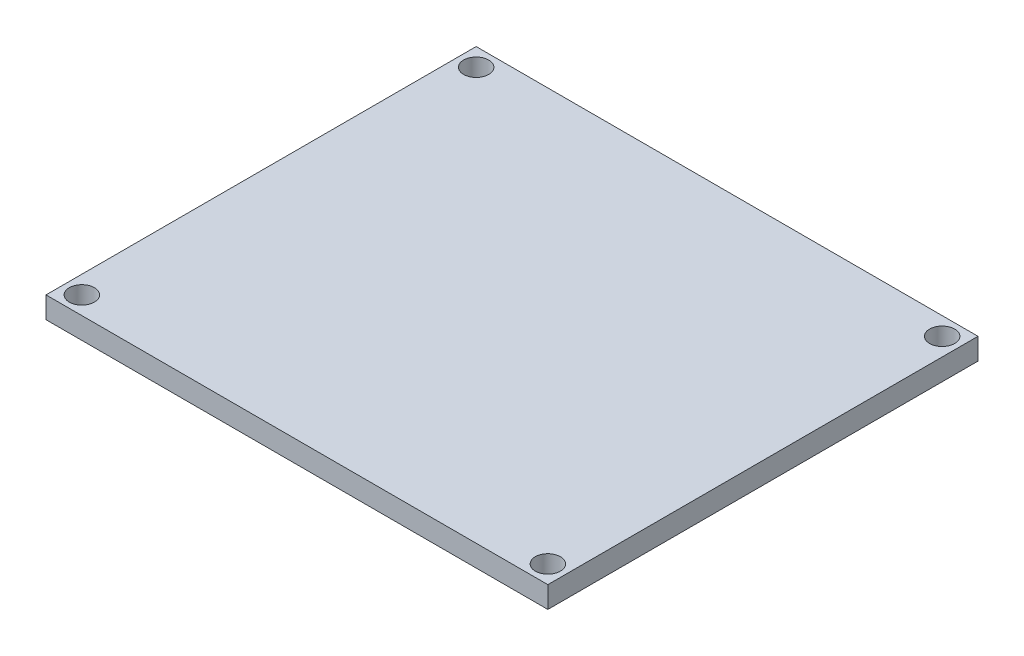
ISO-10303-21;
HEADER;
FILE_DESCRIPTION(('STEP AP214'),'2;1');
FILE_NAME('part.step','',(''),(''),'','','');
FILE_SCHEMA(('AUTOMOTIVE_DESIGN { 1 0 10303 214 1 1 1 1 }'));
ENDSEC;
DATA;
#1=APPLICATION_CONTEXT('core data for automotive mechanical design processes');
#2=APPLICATION_PROTOCOL_DEFINITION('international standard','automotive_design',2000,#1);
#3=PRODUCT_CONTEXT('',#1,'mechanical');
#4=PRODUCT('Part','Part','',(#3));
#5=PRODUCT_RELATED_PRODUCT_CATEGORY('part','',(#4));
#6=PRODUCT_DEFINITION_FORMATION('','',#4);
#7=PRODUCT_DEFINITION_CONTEXT('part definition',#1,'design');
#8=PRODUCT_DEFINITION('design','',#6,#7);
#9=PRODUCT_DEFINITION_SHAPE('','',#8);
#10=(LENGTH_UNIT() NAMED_UNIT(*) SI_UNIT(.MILLI.,.METRE.));
#11=(NAMED_UNIT(*) PLANE_ANGLE_UNIT() SI_UNIT($,.RADIAN.));
#12=(NAMED_UNIT(*) SI_UNIT($,.STERADIAN.) SOLID_ANGLE_UNIT());
#13=UNCERTAINTY_MEASURE_WITH_UNIT(LENGTH_MEASURE(1.E-05),#10,'distance_accuracy_value','');
#14=(GEOMETRIC_REPRESENTATION_CONTEXT(3) GLOBAL_UNCERTAINTY_ASSIGNED_CONTEXT((#13)) GLOBAL_UNIT_ASSIGNED_CONTEXT((#10,
#11,#12)) REPRESENTATION_CONTEXT('',''));
#15=CARTESIAN_POINT('',(0.,0.,0.));
#16=DIRECTION('',(0.,0.,1.));
#17=DIRECTION('',(1.,0.,0.));
#18=AXIS2_PLACEMENT_3D('',#15,#16,#17);
#19=CARTESIAN_POINT('',(-30.9375,3.,11.40625));
#20=DIRECTION('',(1.,0.,0.));
#21=DIRECTION('',(0.,0.,-1.));
#22=AXIS2_PLACEMENT_3D('',#19,#20,#21);
#23=PLANE('',#22);
#24=DIRECTION('',(0.,0.,1.));
#25=VECTOR('',#24,1.);
#26=CARTESIAN_POINT('',(-30.9375,0.,11.40625));
#27=LINE('',#26,#25);
#28=CARTESIAN_POINT('',(-30.9375,0.,-48.59375));
#29=VERTEX_POINT('',#28);
#30=CARTESIAN_POINT('',(-30.9375,0.,11.40625));
#31=VERTEX_POINT('',#30);
#32=EDGE_CURVE('E99',#29,#31,#27,.T.);
#33=ORIENTED_EDGE('',*,*,#32,.T.);
#34=DIRECTION('',(0.,-1.,0.));
#35=VECTOR('',#34,1.);
#36=CARTESIAN_POINT('',(-30.9375,3.,11.40625));
#37=LINE('',#36,#35);
#38=CARTESIAN_POINT('',(-30.9375,3.,11.40625));
#39=VERTEX_POINT('',#38);
#40=EDGE_CURVE('E11',#39,#31,#37,.T.);
#41=ORIENTED_EDGE('',*,*,#40,.F.);
#42=DIRECTION('',(0.,0.,1.));
#43=VECTOR('',#42,1.);
#44=CARTESIAN_POINT('',(-30.9375,3.,11.40625));
#45=LINE('',#44,#43);
#46=CARTESIAN_POINT('',(-30.9375,3.,-48.59375));
#47=VERTEX_POINT('',#46);
#48=EDGE_CURVE('E86',#47,#39,#45,.T.);
#49=ORIENTED_EDGE('',*,*,#48,.F.);
#50=DIRECTION('',(0.,-1.,0.));
#51=VECTOR('',#50,1.);
#52=CARTESIAN_POINT('',(-30.9375,3.,-48.59375));
#53=LINE('',#52,#51);
#54=EDGE_CURVE('E95',#47,#29,#53,.T.);
#55=ORIENTED_EDGE('',*,*,#54,.T.);
#56=EDGE_LOOP('',(#33,#41,#49,#55));
#57=FACE_BOUND('',#56,.T.);
#58=ADVANCED_FACE('F33',(#57),#23,.F.);
#59=CARTESIAN_POINT('',(-30.9375,3.,11.40625));
#60=DIRECTION('',(0.,0.,-1.));
#61=DIRECTION('',(-1.,0.,0.));
#62=AXIS2_PLACEMENT_3D('',#59,#60,#61);
#63=PLANE('',#62);
#64=DIRECTION('',(1.,0.,0.));
#65=VECTOR('',#64,1.);
#66=CARTESIAN_POINT('',(-30.9375,0.,11.40625));
#67=LINE('',#66,#65);
#68=CARTESIAN_POINT('',(39.0625,0.,11.40625));
#69=VERTEX_POINT('',#68);
#70=EDGE_CURVE('E90',#31,#69,#67,.T.);
#71=ORIENTED_EDGE('',*,*,#70,.T.);
#72=DIRECTION('',(0.,-1.,0.));
#73=VECTOR('',#72,1.);
#74=CARTESIAN_POINT('',(39.0625,3.,11.40625));
#75=LINE('',#74,#73);
#76=CARTESIAN_POINT('',(39.0625,3.,11.40625));
#77=VERTEX_POINT('',#76);
#78=EDGE_CURVE('E42',#77,#69,#75,.T.);
#79=ORIENTED_EDGE('',*,*,#78,.F.);
#80=DIRECTION('',(1.,0.,0.));
#81=VECTOR('',#80,1.);
#82=CARTESIAN_POINT('',(-30.9375,3.,11.40625));
#83=LINE('',#82,#81);
#84=EDGE_CURVE('E81',#39,#77,#83,.T.);
#85=ORIENTED_EDGE('',*,*,#84,.F.);
#86=ORIENTED_EDGE('',*,*,#40,.T.);
#87=EDGE_LOOP('',(#71,#79,#85,#86));
#88=FACE_BOUND('',#87,.T.);
#89=ADVANCED_FACE('F89',(#88),#63,.F.);
#90=CARTESIAN_POINT('',(39.0625,3.,11.40625));
#91=DIRECTION('',(-1.,0.,0.));
#92=DIRECTION('',(0.,0.,1.));
#93=AXIS2_PLACEMENT_3D('',#90,#91,#92);
#94=PLANE('',#93);
#95=DIRECTION('',(0.,0.,-1.));
#96=VECTOR('',#95,1.);
#97=CARTESIAN_POINT('',(39.0625,0.,11.40625));
#98=LINE('',#97,#96);
#99=CARTESIAN_POINT('',(39.0625,0.,-48.59375));
#100=VERTEX_POINT('',#99);
#101=EDGE_CURVE('E68',#69,#100,#98,.T.);
#102=ORIENTED_EDGE('',*,*,#101,.T.);
#103=DIRECTION('',(0.,-1.,0.));
#104=VECTOR('',#103,1.);
#105=CARTESIAN_POINT('',(39.0625,3.,-48.59375));
#106=LINE('',#105,#104);
#107=CARTESIAN_POINT('',(39.0625,3.,-48.59375));
#108=VERTEX_POINT('',#107);
#109=EDGE_CURVE('E91',#108,#100,#106,.T.);
#110=ORIENTED_EDGE('',*,*,#109,.F.);
#111=DIRECTION('',(0.,0.,-1.));
#112=VECTOR('',#111,1.);
#113=CARTESIAN_POINT('',(39.0625,3.,11.40625));
#114=LINE('',#113,#112);
#115=EDGE_CURVE('E84',#77,#108,#114,.T.);
#116=ORIENTED_EDGE('',*,*,#115,.F.);
#117=ORIENTED_EDGE('',*,*,#78,.T.);
#118=EDGE_LOOP('',(#102,#110,#116,#117));
#119=FACE_BOUND('',#118,.T.);
#120=ADVANCED_FACE('F93',(#119),#94,.F.);
#121=CARTESIAN_POINT('',(-30.9375,3.,-48.59375));
#122=DIRECTION('',(0.,0.,1.));
#123=DIRECTION('',(1.,0.,0.));
#124=AXIS2_PLACEMENT_3D('',#121,#122,#123);
#125=PLANE('',#124);
#126=DIRECTION('',(-1.,0.,0.));
#127=VECTOR('',#126,1.);
#128=CARTESIAN_POINT('',(-30.9375,0.,-48.59375));
#129=LINE('',#128,#127);
#130=EDGE_CURVE('E74',#100,#29,#129,.T.);
#131=ORIENTED_EDGE('',*,*,#130,.T.);
#132=ORIENTED_EDGE('',*,*,#54,.F.);
#133=DIRECTION('',(-1.,0.,0.));
#134=VECTOR('',#133,1.);
#135=CARTESIAN_POINT('',(-30.9375,3.,-48.59375));
#136=LINE('',#135,#134);
#137=EDGE_CURVE('E51',#108,#47,#136,.T.);
#138=ORIENTED_EDGE('',*,*,#137,.F.);
#139=ORIENTED_EDGE('',*,*,#109,.T.);
#140=EDGE_LOOP('',(#131,#132,#138,#139));
#141=FACE_BOUND('',#140,.T.);
#142=ADVANCED_FACE('F135',(#141),#125,.F.);
#143=CARTESIAN_POINT('',(0.,3.,0.));
#144=DIRECTION('',(0.,-1.,0.));
#145=DIRECTION('',(0.,0.,-1.));
#146=AXIS2_PLACEMENT_3D('',#143,#144,#145);
#147=PLANE('',#146);
#148=CARTESIAN_POINT('',(-28.4375,3.,8.90624999999998));
#149=DIRECTION('',(0.,1.,0.));
#150=DIRECTION('',(0.,0.,1.));
#151=AXIS2_PLACEMENT_3D('',#148,#149,#150);
#152=CIRCLE('',#151,1.75);
#153=CARTESIAN_POINT('',(-28.4375,3.,10.65625));
#154=VERTEX_POINT('',#153);
#155=EDGE_CURVE('E217',#154,#154,#152,.T.);
#156=ORIENTED_EDGE('',*,*,#155,.F.);
#157=EDGE_LOOP('',(#156));
#158=FACE_BOUND('',#157,.T.);
#159=CARTESIAN_POINT('',(36.5625,3.,8.90624999999999));
#160=DIRECTION('',(0.,1.,0.));
#161=DIRECTION('',(0.,0.,1.));
#162=AXIS2_PLACEMENT_3D('',#159,#160,#161);
#163=CIRCLE('',#162,1.75);
#164=CARTESIAN_POINT('',(36.5625,3.,10.65625));
#165=VERTEX_POINT('',#164);
#166=EDGE_CURVE('E214',#165,#165,#163,.T.);
#167=ORIENTED_EDGE('',*,*,#166,.F.);
#168=EDGE_LOOP('',(#167));
#169=FACE_BOUND('',#168,.T.);
#170=CARTESIAN_POINT('',(36.5625,3.,-46.09375));
#171=DIRECTION('',(0.,1.,0.));
#172=DIRECTION('',(0.,0.,1.));
#173=AXIS2_PLACEMENT_3D('',#170,#171,#172);
#174=CIRCLE('',#173,1.75);
#175=CARTESIAN_POINT('',(36.5625,3.,-44.34375));
#176=VERTEX_POINT('',#175);
#177=EDGE_CURVE('E216',#176,#176,#174,.T.);
#178=ORIENTED_EDGE('',*,*,#177,.F.);
#179=EDGE_LOOP('',(#178));
#180=FACE_BOUND('',#179,.T.);
#181=CARTESIAN_POINT('',(-28.4375,3.,-46.09375));
#182=DIRECTION('',(0.,1.,0.));
#183=DIRECTION('',(0.,0.,1.));
#184=AXIS2_PLACEMENT_3D('',#181,#182,#183);
#185=CIRCLE('',#184,1.75);
#186=CARTESIAN_POINT('',(-28.4375,3.,-44.34375));
#187=VERTEX_POINT('',#186);
#188=EDGE_CURVE('E111',#187,#187,#185,.T.);
#189=ORIENTED_EDGE('',*,*,#188,.F.);
#190=EDGE_LOOP('',(#189));
#191=FACE_BOUND('',#190,.T.);
#192=ORIENTED_EDGE('',*,*,#48,.T.);
#193=ORIENTED_EDGE('',*,*,#84,.T.);
#194=ORIENTED_EDGE('',*,*,#115,.T.);
#195=ORIENTED_EDGE('',*,*,#137,.T.);
#196=EDGE_LOOP('',(#192,#193,#194,#195));
#197=FACE_BOUND('',#196,.T.);
#198=ADVANCED_FACE('F82',(#158,#169,#180,#191,#197),#147,.F.);
#199=CARTESIAN_POINT('',(0.,0.,0.));
#200=DIRECTION('',(0.,-1.,0.));
#201=DIRECTION('',(0.,0.,-1.));
#202=AXIS2_PLACEMENT_3D('',#199,#200,#201);
#203=PLANE('',#202);
#204=CARTESIAN_POINT('',(-28.4375,0.,8.90624999999998));
#205=DIRECTION('',(0.,-1.,0.));
#206=DIRECTION('',(0.,0.,-1.));
#207=AXIS2_PLACEMENT_3D('',#204,#205,#206);
#208=CIRCLE('',#207,1.75);
#209=CARTESIAN_POINT('',(-28.4375,0.,7.15624999999998));
#210=VERTEX_POINT('',#209);
#211=EDGE_CURVE('E36',#210,#210,#208,.T.);
#212=ORIENTED_EDGE('',*,*,#211,.F.);
#213=EDGE_LOOP('',(#212));
#214=FACE_BOUND('',#213,.T.);
#215=CARTESIAN_POINT('',(36.5625,0.,8.90624999999999));
#216=DIRECTION('',(0.,-1.,0.));
#217=DIRECTION('',(0.,0.,-1.));
#218=AXIS2_PLACEMENT_3D('',#215,#216,#217);
#219=CIRCLE('',#218,1.75);
#220=CARTESIAN_POINT('',(36.5625,0.,7.15624999999998));
#221=VERTEX_POINT('',#220);
#222=EDGE_CURVE('E113',#221,#221,#219,.T.);
#223=ORIENTED_EDGE('',*,*,#222,.F.);
#224=EDGE_LOOP('',(#223));
#225=FACE_BOUND('',#224,.T.);
#226=CARTESIAN_POINT('',(36.5625,0.,-46.09375));
#227=DIRECTION('',(0.,-1.,0.));
#228=DIRECTION('',(0.,0.,-1.));
#229=AXIS2_PLACEMENT_3D('',#226,#227,#228);
#230=CIRCLE('',#229,1.75);
#231=CARTESIAN_POINT('',(36.5625,0.,-47.84375));
#232=VERTEX_POINT('',#231);
#233=EDGE_CURVE('E110',#232,#232,#230,.T.);
#234=ORIENTED_EDGE('',*,*,#233,.F.);
#235=EDGE_LOOP('',(#234));
#236=FACE_BOUND('',#235,.T.);
#237=CARTESIAN_POINT('',(-28.4375,0.,-46.09375));
#238=DIRECTION('',(0.,-1.,0.));
#239=DIRECTION('',(0.,0.,-1.));
#240=AXIS2_PLACEMENT_3D('',#237,#238,#239);
#241=CIRCLE('',#240,1.75);
#242=CARTESIAN_POINT('',(-28.4375,0.,-47.84375));
#243=VERTEX_POINT('',#242);
#244=EDGE_CURVE('E107',#243,#243,#241,.T.);
#245=ORIENTED_EDGE('',*,*,#244,.F.);
#246=EDGE_LOOP('',(#245));
#247=FACE_BOUND('',#246,.T.);
#248=ORIENTED_EDGE('',*,*,#32,.F.);
#249=ORIENTED_EDGE('',*,*,#130,.F.);
#250=ORIENTED_EDGE('',*,*,#101,.F.);
#251=ORIENTED_EDGE('',*,*,#70,.F.);
#252=EDGE_LOOP('',(#248,#249,#250,#251));
#253=FACE_BOUND('',#252,.T.);
#254=ADVANCED_FACE('F123',(#214,#225,#236,#247,#253),#203,.T.);
#255=CARTESIAN_POINT('',(-28.4375,-3.,-46.09375));
#256=DIRECTION('',(0.,1.,0.));
#257=DIRECTION('',(0.,0.,1.));
#258=AXIS2_PLACEMENT_3D('',#255,#256,#257);
#259=CYLINDRICAL_SURFACE('',#258,1.75);
#260=ORIENTED_EDGE('',*,*,#244,.T.);
#261=EDGE_LOOP('',(#260));
#262=FACE_BOUND('',#261,.T.);
#263=ORIENTED_EDGE('',*,*,#188,.T.);
#264=EDGE_LOOP('',(#263));
#265=FACE_BOUND('',#264,.T.);
#266=ADVANCED_FACE('F126',(#262,#265),#259,.F.);
#267=CARTESIAN_POINT('',(36.5625,-3.,-46.09375));
#268=DIRECTION('',(0.,1.,0.));
#269=DIRECTION('',(0.,0.,1.));
#270=AXIS2_PLACEMENT_3D('',#267,#268,#269);
#271=CYLINDRICAL_SURFACE('',#270,1.75);
#272=ORIENTED_EDGE('',*,*,#233,.T.);
#273=EDGE_LOOP('',(#272));
#274=FACE_BOUND('',#273,.T.);
#275=ORIENTED_EDGE('',*,*,#177,.T.);
#276=EDGE_LOOP('',(#275));
#277=FACE_BOUND('',#276,.T.);
#278=ADVANCED_FACE('F180',(#274,#277),#271,.F.);
#279=CARTESIAN_POINT('',(36.5625,-3.,8.90624999999999));
#280=DIRECTION('',(0.,1.,0.));
#281=DIRECTION('',(0.,0.,1.));
#282=AXIS2_PLACEMENT_3D('',#279,#280,#281);
#283=CYLINDRICAL_SURFACE('',#282,1.75);
#284=ORIENTED_EDGE('',*,*,#222,.T.);
#285=EDGE_LOOP('',(#284));
#286=FACE_BOUND('',#285,.T.);
#287=ORIENTED_EDGE('',*,*,#166,.T.);
#288=EDGE_LOOP('',(#287));
#289=FACE_BOUND('',#288,.T.);
#290=ADVANCED_FACE('F190',(#286,#289),#283,.F.);
#291=CARTESIAN_POINT('',(-28.4375,-3.,8.90624999999998));
#292=DIRECTION('',(0.,1.,0.));
#293=DIRECTION('',(0.,0.,1.));
#294=AXIS2_PLACEMENT_3D('',#291,#292,#293);
#295=CYLINDRICAL_SURFACE('',#294,1.75);
#296=ORIENTED_EDGE('',*,*,#211,.T.);
#297=EDGE_LOOP('',(#296));
#298=FACE_BOUND('',#297,.T.);
#299=ORIENTED_EDGE('',*,*,#155,.T.);
#300=EDGE_LOOP('',(#299));
#301=FACE_BOUND('',#300,.T.);
#302=ADVANCED_FACE('F120',(#298,#301),#295,.F.);
#303=CLOSED_SHELL('',(#58,#89,#120,#142,#198,#254,#266,#278,#290,#302));
#304=MANIFOLD_SOLID_BREP('B2',#303);
#305=ADVANCED_BREP_SHAPE_REPRESENTATION('',(#18,#304),#14);
#306=SHAPE_DEFINITION_REPRESENTATION(#9,#305);
ENDSEC;
END-ISO-10303-21;
